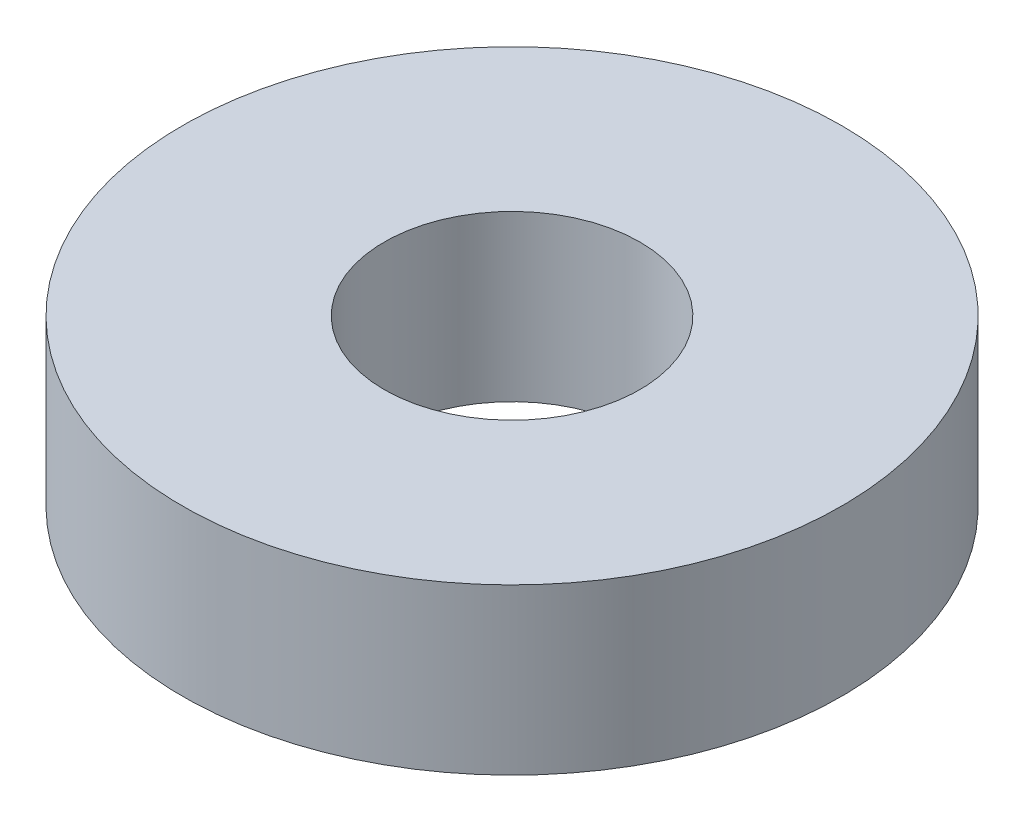
ISO-10303-21;
HEADER;
FILE_DESCRIPTION(('STEP AP214'),'2;1');
FILE_NAME('part.step','',(''),(''),'','','');
FILE_SCHEMA(('AUTOMOTIVE_DESIGN { 1 0 10303 214 1 1 1 1 }'));
ENDSEC;
DATA;
#1=APPLICATION_CONTEXT('core data for automotive mechanical design processes');
#2=APPLICATION_PROTOCOL_DEFINITION('international standard','automotive_design',2000,#1);
#3=PRODUCT_CONTEXT('',#1,'mechanical');
#4=PRODUCT('Part','Part','',(#3));
#5=PRODUCT_RELATED_PRODUCT_CATEGORY('part','',(#4));
#6=PRODUCT_DEFINITION_FORMATION('','',#4);
#7=PRODUCT_DEFINITION_CONTEXT('part definition',#1,'design');
#8=PRODUCT_DEFINITION('design','',#6,#7);
#9=PRODUCT_DEFINITION_SHAPE('','',#8);
#10=(LENGTH_UNIT() NAMED_UNIT(*) SI_UNIT(.MILLI.,.METRE.));
#11=(NAMED_UNIT(*) PLANE_ANGLE_UNIT() SI_UNIT($,.RADIAN.));
#12=(NAMED_UNIT(*) SI_UNIT($,.STERADIAN.) SOLID_ANGLE_UNIT());
#13=UNCERTAINTY_MEASURE_WITH_UNIT(LENGTH_MEASURE(1.E-05),#10,'distance_accuracy_value','');
#14=(GEOMETRIC_REPRESENTATION_CONTEXT(3) GLOBAL_UNCERTAINTY_ASSIGNED_CONTEXT((#13)) GLOBAL_UNIT_ASSIGNED_CONTEXT((#10,
#11,#12)) REPRESENTATION_CONTEXT('',''));
#15=CARTESIAN_POINT('',(0.,0.,0.));
#16=DIRECTION('',(0.,0.,1.));
#17=DIRECTION('',(1.,0.,0.));
#18=AXIS2_PLACEMENT_3D('',#15,#16,#17);
#19=CARTESIAN_POINT('',(0.,-1.5875,0.));
#20=DIRECTION('',(0.,1.,0.));
#21=DIRECTION('',(0.,0.,1.));
#22=AXIS2_PLACEMENT_3D('',#19,#20,#21);
#23=PLANE('',#22);
#24=CARTESIAN_POINT('',(0.,-1.5875,0.));
#25=DIRECTION('',(0.,-1.,0.));
#26=DIRECTION('',(0.,0.,-1.));
#27=AXIS2_PLACEMENT_3D('',#24,#25,#26);
#28=CIRCLE('',#27,2.4638);
#29=CARTESIAN_POINT('',(0.,-1.5875,-2.4638));
#30=VERTEX_POINT('',#29);
#31=EDGE_CURVE('E25',#30,#30,#28,.F.);
#32=ORIENTED_EDGE('',*,*,#31,.T.);
#33=EDGE_LOOP('',(#32));
#34=FACE_BOUND('',#33,.T.);
#35=CARTESIAN_POINT('',(0.,-1.5875,0.));
#36=DIRECTION('',(0.,-1.,0.));
#37=DIRECTION('',(0.,0.,-1.));
#38=AXIS2_PLACEMENT_3D('',#35,#36,#37);
#39=CIRCLE('',#38,6.35);
#40=CARTESIAN_POINT('',(0.,-1.5875,-6.35));
#41=VERTEX_POINT('',#40);
#42=EDGE_CURVE('E16',#41,#41,#39,.F.);
#43=ORIENTED_EDGE('',*,*,#42,.F.);
#44=EDGE_LOOP('',(#43));
#45=FACE_BOUND('',#44,.T.);
#46=ADVANCED_FACE('F13',(#34,#45),#23,.F.);
#47=CARTESIAN_POINT('',(0.,1.5875,0.));
#48=DIRECTION('',(0.,-1.,0.));
#49=DIRECTION('',(0.,0.,-1.));
#50=AXIS2_PLACEMENT_3D('',#47,#48,#49);
#51=CYLINDRICAL_SURFACE('',#50,6.35);
#52=ORIENTED_EDGE('',*,*,#42,.T.);
#53=EDGE_LOOP('',(#52));
#54=FACE_BOUND('',#53,.T.);
#55=CARTESIAN_POINT('',(0.,1.5875,0.));
#56=DIRECTION('',(0.,-1.,0.));
#57=DIRECTION('',(0.,0.,-1.));
#58=AXIS2_PLACEMENT_3D('',#55,#56,#57);
#59=CIRCLE('',#58,6.35);
#60=CARTESIAN_POINT('',(0.,1.5875,-6.35));
#61=VERTEX_POINT('',#60);
#62=EDGE_CURVE('E20',#61,#61,#59,.F.);
#63=ORIENTED_EDGE('',*,*,#62,.F.);
#64=EDGE_LOOP('',(#63));
#65=FACE_BOUND('',#64,.T.);
#66=ADVANCED_FACE('F33',(#54,#65),#51,.T.);
#67=CARTESIAN_POINT('',(0.,1.5875,0.));
#68=DIRECTION('',(0.,-1.,0.));
#69=DIRECTION('',(0.,0.,-1.));
#70=AXIS2_PLACEMENT_3D('',#67,#68,#69);
#71=CYLINDRICAL_SURFACE('',#70,2.4638);
#72=CARTESIAN_POINT('',(0.,1.5875,0.));
#73=DIRECTION('',(0.,-1.,0.));
#74=DIRECTION('',(0.,0.,-1.));
#75=AXIS2_PLACEMENT_3D('',#72,#73,#74);
#76=CIRCLE('',#75,2.4638);
#77=CARTESIAN_POINT('',(0.,1.5875,-2.4638));
#78=VERTEX_POINT('',#77);
#79=EDGE_CURVE('E8',#78,#78,#76,.T.);
#80=ORIENTED_EDGE('',*,*,#79,.F.);
#81=EDGE_LOOP('',(#80));
#82=FACE_BOUND('',#81,.T.);
#83=ORIENTED_EDGE('',*,*,#31,.F.);
#84=EDGE_LOOP('',(#83));
#85=FACE_BOUND('',#84,.T.);
#86=ADVANCED_FACE('F41',(#82,#85),#71,.F.);
#87=CARTESIAN_POINT('',(0.,1.5875,0.));
#88=DIRECTION('',(0.,1.,0.));
#89=DIRECTION('',(0.,0.,1.));
#90=AXIS2_PLACEMENT_3D('',#87,#88,#89);
#91=PLANE('',#90);
#92=ORIENTED_EDGE('',*,*,#79,.T.);
#93=EDGE_LOOP('',(#92));
#94=FACE_BOUND('',#93,.T.);
#95=ORIENTED_EDGE('',*,*,#62,.T.);
#96=EDGE_LOOP('',(#95));
#97=FACE_BOUND('',#96,.T.);
#98=ADVANCED_FACE('F42',(#94,#97),#91,.T.);
#99=CLOSED_SHELL('',(#46,#66,#86,#98));
#100=MANIFOLD_SOLID_BREP('B1',#99);
#101=ADVANCED_BREP_SHAPE_REPRESENTATION('',(#18,#100),#14);
#102=SHAPE_DEFINITION_REPRESENTATION(#9,#101);
ENDSEC;
END-ISO-10303-21;
